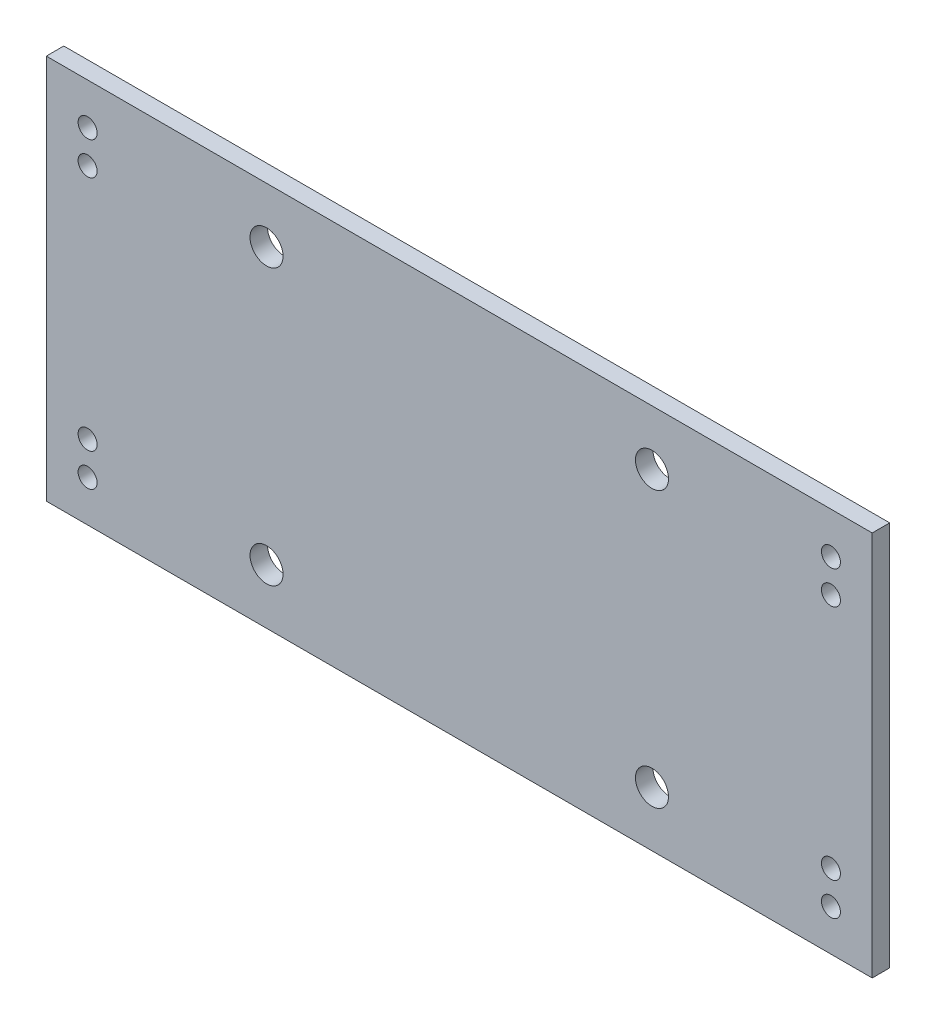
ISO-10303-21;
HEADER;
FILE_DESCRIPTION(('STEP AP214'),'2;1');
FILE_NAME('part.step','',(''),(''),'','','');
FILE_SCHEMA(('AUTOMOTIVE_DESIGN { 1 0 10303 214 1 1 1 1 }'));
ENDSEC;
DATA;
#1=APPLICATION_CONTEXT('core data for automotive mechanical design processes');
#2=APPLICATION_PROTOCOL_DEFINITION('international standard','automotive_design',2000,#1);
#3=PRODUCT_CONTEXT('',#1,'mechanical');
#4=PRODUCT('Part','Part','',(#3));
#5=PRODUCT_RELATED_PRODUCT_CATEGORY('part','',(#4));
#6=PRODUCT_DEFINITION_FORMATION('','',#4);
#7=PRODUCT_DEFINITION_CONTEXT('part definition',#1,'design');
#8=PRODUCT_DEFINITION('design','',#6,#7);
#9=PRODUCT_DEFINITION_SHAPE('','',#8);
#10=(LENGTH_UNIT() NAMED_UNIT(*) SI_UNIT(.MILLI.,.METRE.));
#11=(NAMED_UNIT(*) PLANE_ANGLE_UNIT() SI_UNIT($,.RADIAN.));
#12=(NAMED_UNIT(*) SI_UNIT($,.STERADIAN.) SOLID_ANGLE_UNIT());
#13=UNCERTAINTY_MEASURE_WITH_UNIT(LENGTH_MEASURE(1.E-05),#10,'distance_accuracy_value','');
#14=(GEOMETRIC_REPRESENTATION_CONTEXT(3) GLOBAL_UNCERTAINTY_ASSIGNED_CONTEXT((#13)) GLOBAL_UNIT_ASSIGNED_CONTEXT((#10,
#11,#12)) REPRESENTATION_CONTEXT('',''));
#15=CARTESIAN_POINT('',(0.,0.,0.));
#16=DIRECTION('',(0.,0.,1.));
#17=DIRECTION('',(1.,0.,0.));
#18=AXIS2_PLACEMENT_3D('',#15,#16,#17);
#19=CARTESIAN_POINT('',(150.,0.,3.175));
#20=DIRECTION('',(1.,0.,0.));
#21=DIRECTION('',(0.,0.,-1.));
#22=AXIS2_PLACEMENT_3D('',#19,#20,#21);
#23=PLANE('',#22);
#24=DIRECTION('',(0.,-1.,0.));
#25=VECTOR('',#24,1.);
#26=CARTESIAN_POINT('',(150.,0.,0.));
#27=LINE('',#26,#25);
#28=CARTESIAN_POINT('',(150.,0.,0.));
#29=VERTEX_POINT('',#28);
#30=CARTESIAN_POINT('',(150.,-70.,0.));
#31=VERTEX_POINT('',#30);
#32=EDGE_CURVE('E167',#29,#31,#27,.T.);
#33=ORIENTED_EDGE('',*,*,#32,.F.);
#34=DIRECTION('',(0.,0.,-1.));
#35=VECTOR('',#34,1.);
#36=CARTESIAN_POINT('',(150.,0.,3.175));
#37=LINE('',#36,#35);
#38=CARTESIAN_POINT('',(150.,0.,3.175));
#39=VERTEX_POINT('',#38);
#40=EDGE_CURVE('E11',#39,#29,#37,.T.);
#41=ORIENTED_EDGE('',*,*,#40,.F.);
#42=DIRECTION('',(0.,-1.,0.));
#43=VECTOR('',#42,1.);
#44=CARTESIAN_POINT('',(150.,0.,3.175));
#45=LINE('',#44,#43);
#46=CARTESIAN_POINT('',(150.,-70.,3.175));
#47=VERTEX_POINT('',#46);
#48=EDGE_CURVE('E109',#39,#47,#45,.T.);
#49=ORIENTED_EDGE('',*,*,#48,.T.);
#50=DIRECTION('',(0.,0.,-1.));
#51=VECTOR('',#50,1.);
#52=CARTESIAN_POINT('',(150.,-70.,3.175));
#53=LINE('',#52,#51);
#54=EDGE_CURVE('E86',#47,#31,#53,.T.);
#55=ORIENTED_EDGE('',*,*,#54,.T.);
#56=EDGE_LOOP('',(#33,#41,#49,#55));
#57=FACE_BOUND('',#56,.T.);
#58=ADVANCED_FACE('F45',(#57),#23,.T.);
#59=CARTESIAN_POINT('',(0.,0.,3.175));
#60=DIRECTION('',(0.,1.,0.));
#61=DIRECTION('',(0.,0.,1.));
#62=AXIS2_PLACEMENT_3D('',#59,#60,#61);
#63=PLANE('',#62);
#64=DIRECTION('',(1.,0.,0.));
#65=VECTOR('',#64,1.);
#66=CARTESIAN_POINT('',(0.,0.,0.));
#67=LINE('',#66,#65);
#68=CARTESIAN_POINT('',(0.,0.,0.));
#69=VERTEX_POINT('',#68);
#70=EDGE_CURVE('E98',#69,#29,#67,.T.);
#71=ORIENTED_EDGE('',*,*,#70,.F.);
#72=DIRECTION('',(0.,0.,-1.));
#73=VECTOR('',#72,1.);
#74=CARTESIAN_POINT('',(0.,0.,3.175));
#75=LINE('',#74,#73);
#76=CARTESIAN_POINT('',(0.,0.,3.175));
#77=VERTEX_POINT('',#76);
#78=EDGE_CURVE('E55',#77,#69,#75,.T.);
#79=ORIENTED_EDGE('',*,*,#78,.F.);
#80=DIRECTION('',(1.,0.,0.));
#81=VECTOR('',#80,1.);
#82=CARTESIAN_POINT('',(0.,0.,3.175));
#83=LINE('',#82,#81);
#84=EDGE_CURVE('E96',#77,#39,#83,.T.);
#85=ORIENTED_EDGE('',*,*,#84,.T.);
#86=ORIENTED_EDGE('',*,*,#40,.T.);
#87=EDGE_LOOP('',(#71,#79,#85,#86));
#88=FACE_BOUND('',#87,.T.);
#89=ADVANCED_FACE('F94',(#88),#63,.T.);
#90=CARTESIAN_POINT('',(0.,0.,3.175));
#91=DIRECTION('',(1.,0.,0.));
#92=DIRECTION('',(0.,1.,0.));
#93=AXIS2_PLACEMENT_3D('',#90,#91,#92);
#94=PLANE('',#93);
#95=DIRECTION('',(0.,-1.,0.));
#96=VECTOR('',#95,1.);
#97=CARTESIAN_POINT('',(0.,0.,0.));
#98=LINE('',#97,#96);
#99=CARTESIAN_POINT('',(0.,-70.,0.));
#100=VERTEX_POINT('',#99);
#101=EDGE_CURVE('E172',#69,#100,#98,.T.);
#102=ORIENTED_EDGE('',*,*,#101,.T.);
#103=DIRECTION('',(0.,0.,-1.));
#104=VECTOR('',#103,1.);
#105=CARTESIAN_POINT('',(0.,-70.,3.175));
#106=LINE('',#105,#104);
#107=CARTESIAN_POINT('',(0.,-70.,3.175));
#108=VERTEX_POINT('',#107);
#109=EDGE_CURVE('E102',#108,#100,#106,.T.);
#110=ORIENTED_EDGE('',*,*,#109,.F.);
#111=DIRECTION('',(0.,-1.,0.));
#112=VECTOR('',#111,1.);
#113=CARTESIAN_POINT('',(0.,0.,3.175));
#114=LINE('',#113,#112);
#115=EDGE_CURVE('E104',#77,#108,#114,.T.);
#116=ORIENTED_EDGE('',*,*,#115,.F.);
#117=ORIENTED_EDGE('',*,*,#78,.T.);
#118=EDGE_LOOP('',(#102,#110,#116,#117));
#119=FACE_BOUND('',#118,.T.);
#120=ADVANCED_FACE('F105',(#119),#94,.F.);
#121=CARTESIAN_POINT('',(7.49999999999998,-7.49999999999998,3.175));
#122=DIRECTION('',(0.,0.,-1.));
#123=DIRECTION('',(-1.,0.,0.));
#124=AXIS2_PLACEMENT_3D('',#121,#122,#123);
#125=CYLINDRICAL_SURFACE('',#124,1.725);
#126=CARTESIAN_POINT('',(7.49999999999998,-7.49999999999998,3.175));
#127=DIRECTION('',(0.,0.,1.));
#128=DIRECTION('',(1.,0.,0.));
#129=AXIS2_PLACEMENT_3D('',#126,#127,#128);
#130=CIRCLE('',#129,1.725);
#131=CARTESIAN_POINT('',(9.22499999999998,-7.49999999999998,3.175));
#132=VERTEX_POINT('',#131);
#133=EDGE_CURVE('E113',#132,#132,#130,.T.);
#134=ORIENTED_EDGE('',*,*,#133,.T.);
#135=EDGE_LOOP('',(#134));
#136=FACE_BOUND('',#135,.T.);
#137=CARTESIAN_POINT('',(7.49999999999998,-7.49999999999998,0.));
#138=DIRECTION('',(0.,0.,1.));
#139=DIRECTION('',(1.,0.,0.));
#140=AXIS2_PLACEMENT_3D('',#137,#138,#139);
#141=CIRCLE('',#140,1.725);
#142=CARTESIAN_POINT('',(9.22499999999998,-7.49999999999998,0.));
#143=VERTEX_POINT('',#142);
#144=EDGE_CURVE('E163',#143,#143,#141,.T.);
#145=ORIENTED_EDGE('',*,*,#144,.F.);
#146=EDGE_LOOP('',(#145));
#147=FACE_BOUND('',#146,.T.);
#148=ADVANCED_FACE('F192',(#136,#147),#125,.F.);
#149=CARTESIAN_POINT('',(142.5,-7.49999999999999,3.175));
#150=DIRECTION('',(0.,0.,-1.));
#151=DIRECTION('',(-1.,0.,0.));
#152=AXIS2_PLACEMENT_3D('',#149,#150,#151);
#153=CYLINDRICAL_SURFACE('',#152,1.72500000000002);
#154=CARTESIAN_POINT('',(142.5,-7.49999999999999,3.175));
#155=DIRECTION('',(0.,0.,1.));
#156=DIRECTION('',(1.,0.,0.));
#157=AXIS2_PLACEMENT_3D('',#154,#155,#156);
#158=CIRCLE('',#157,1.72500000000002);
#159=CARTESIAN_POINT('',(144.225,-7.49999999999999,3.175));
#160=VERTEX_POINT('',#159);
#161=EDGE_CURVE('E464',#160,#160,#158,.T.);
#162=ORIENTED_EDGE('',*,*,#161,.T.);
#163=EDGE_LOOP('',(#162));
#164=FACE_BOUND('',#163,.T.);
#165=CARTESIAN_POINT('',(142.5,-7.49999999999999,0.));
#166=DIRECTION('',(0.,0.,1.));
#167=DIRECTION('',(1.,0.,0.));
#168=AXIS2_PLACEMENT_3D('',#165,#166,#167);
#169=CIRCLE('',#168,1.72500000000002);
#170=CARTESIAN_POINT('',(144.225,-7.49999999999999,0.));
#171=VERTEX_POINT('',#170);
#172=EDGE_CURVE('E159',#171,#171,#169,.T.);
#173=ORIENTED_EDGE('',*,*,#172,.F.);
#174=EDGE_LOOP('',(#173));
#175=FACE_BOUND('',#174,.T.);
#176=ADVANCED_FACE('F195',(#164,#175),#153,.F.);
#177=CARTESIAN_POINT('',(142.5,-62.5,3.175));
#178=DIRECTION('',(0.,0.,-1.));
#179=DIRECTION('',(-1.,0.,0.));
#180=AXIS2_PLACEMENT_3D('',#177,#178,#179);
#181=CYLINDRICAL_SURFACE('',#180,1.725);
#182=CARTESIAN_POINT('',(142.5,-62.5,3.175));
#183=DIRECTION('',(0.,0.,1.));
#184=DIRECTION('',(1.,0.,0.));
#185=AXIS2_PLACEMENT_3D('',#182,#183,#184);
#186=CIRCLE('',#185,1.725);
#187=CARTESIAN_POINT('',(144.225,-62.5,3.175));
#188=VERTEX_POINT('',#187);
#189=EDGE_CURVE('E460',#188,#188,#186,.T.);
#190=ORIENTED_EDGE('',*,*,#189,.T.);
#191=EDGE_LOOP('',(#190));
#192=FACE_BOUND('',#191,.T.);
#193=CARTESIAN_POINT('',(142.5,-62.5,0.));
#194=DIRECTION('',(0.,0.,1.));
#195=DIRECTION('',(1.,0.,0.));
#196=AXIS2_PLACEMENT_3D('',#193,#194,#195);
#197=CIRCLE('',#196,1.725);
#198=CARTESIAN_POINT('',(144.225,-62.5,0.));
#199=VERTEX_POINT('',#198);
#200=EDGE_CURVE('E155',#199,#199,#197,.T.);
#201=ORIENTED_EDGE('',*,*,#200,.F.);
#202=EDGE_LOOP('',(#201));
#203=FACE_BOUND('',#202,.T.);
#204=ADVANCED_FACE('F199',(#192,#203),#181,.F.);
#205=CARTESIAN_POINT('',(7.5,-62.5,3.175));
#206=DIRECTION('',(0.,0.,-1.));
#207=DIRECTION('',(-1.,0.,0.));
#208=AXIS2_PLACEMENT_3D('',#205,#206,#207);
#209=CYLINDRICAL_SURFACE('',#208,1.72499999999999);
#210=CARTESIAN_POINT('',(7.5,-62.5,3.175));
#211=DIRECTION('',(0.,0.,1.));
#212=DIRECTION('',(1.,0.,0.));
#213=AXIS2_PLACEMENT_3D('',#210,#211,#212);
#214=CIRCLE('',#213,1.72499999999999);
#215=CARTESIAN_POINT('',(9.22499999999999,-62.5,3.175));
#216=VERTEX_POINT('',#215);
#217=EDGE_CURVE('E456',#216,#216,#214,.T.);
#218=ORIENTED_EDGE('',*,*,#217,.T.);
#219=EDGE_LOOP('',(#218));
#220=FACE_BOUND('',#219,.T.);
#221=CARTESIAN_POINT('',(7.5,-62.5,0.));
#222=DIRECTION('',(0.,0.,1.));
#223=DIRECTION('',(1.,0.,0.));
#224=AXIS2_PLACEMENT_3D('',#221,#222,#223);
#225=CIRCLE('',#224,1.72499999999999);
#226=CARTESIAN_POINT('',(9.22499999999999,-62.5,0.));
#227=VERTEX_POINT('',#226);
#228=EDGE_CURVE('E151',#227,#227,#225,.T.);
#229=ORIENTED_EDGE('',*,*,#228,.F.);
#230=EDGE_LOOP('',(#229));
#231=FACE_BOUND('',#230,.T.);
#232=ADVANCED_FACE('F203',(#220,#231),#209,.F.);
#233=CARTESIAN_POINT('',(7.49999999999998,-13.5,3.175));
#234=DIRECTION('',(0.,0.,-1.));
#235=DIRECTION('',(-1.,0.,0.));
#236=AXIS2_PLACEMENT_3D('',#233,#234,#235);
#237=CYLINDRICAL_SURFACE('',#236,1.72500000000003);
#238=CARTESIAN_POINT('',(7.49999999999998,-13.5,3.175));
#239=DIRECTION('',(0.,0.,1.));
#240=DIRECTION('',(1.,0.,0.));
#241=AXIS2_PLACEMENT_3D('',#238,#239,#240);
#242=CIRCLE('',#241,1.72500000000003);
#243=CARTESIAN_POINT('',(9.22500000000001,-13.5,3.175));
#244=VERTEX_POINT('',#243);
#245=EDGE_CURVE('E452',#244,#244,#242,.T.);
#246=ORIENTED_EDGE('',*,*,#245,.T.);
#247=EDGE_LOOP('',(#246));
#248=FACE_BOUND('',#247,.T.);
#249=CARTESIAN_POINT('',(7.49999999999998,-13.5,0.));
#250=DIRECTION('',(0.,0.,1.));
#251=DIRECTION('',(1.,0.,0.));
#252=AXIS2_PLACEMENT_3D('',#249,#250,#251);
#253=CIRCLE('',#252,1.72500000000003);
#254=CARTESIAN_POINT('',(9.22500000000001,-13.5,0.));
#255=VERTEX_POINT('',#254);
#256=EDGE_CURVE('E147',#255,#255,#253,.T.);
#257=ORIENTED_EDGE('',*,*,#256,.F.);
#258=EDGE_LOOP('',(#257));
#259=FACE_BOUND('',#258,.T.);
#260=ADVANCED_FACE('F207',(#248,#259),#237,.F.);
#261=CARTESIAN_POINT('',(142.5,-13.5,3.175));
#262=DIRECTION('',(0.,0.,-1.));
#263=DIRECTION('',(-1.,0.,0.));
#264=AXIS2_PLACEMENT_3D('',#261,#262,#263);
#265=CYLINDRICAL_SURFACE('',#264,1.725);
#266=CARTESIAN_POINT('',(142.5,-13.5,3.175));
#267=DIRECTION('',(0.,0.,1.));
#268=DIRECTION('',(1.,0.,0.));
#269=AXIS2_PLACEMENT_3D('',#266,#267,#268);
#270=CIRCLE('',#269,1.725);
#271=CARTESIAN_POINT('',(144.225,-13.5,3.175));
#272=VERTEX_POINT('',#271);
#273=EDGE_CURVE('E448',#272,#272,#270,.T.);
#274=ORIENTED_EDGE('',*,*,#273,.T.);
#275=EDGE_LOOP('',(#274));
#276=FACE_BOUND('',#275,.T.);
#277=CARTESIAN_POINT('',(142.5,-13.5,0.));
#278=DIRECTION('',(0.,0.,1.));
#279=DIRECTION('',(1.,0.,0.));
#280=AXIS2_PLACEMENT_3D('',#277,#278,#279);
#281=CIRCLE('',#280,1.725);
#282=CARTESIAN_POINT('',(144.225,-13.5,0.));
#283=VERTEX_POINT('',#282);
#284=EDGE_CURVE('E143',#283,#283,#281,.T.);
#285=ORIENTED_EDGE('',*,*,#284,.F.);
#286=EDGE_LOOP('',(#285));
#287=FACE_BOUND('',#286,.T.);
#288=ADVANCED_FACE('F211',(#276,#287),#265,.F.);
#289=CARTESIAN_POINT('',(142.5,-56.5,3.175));
#290=DIRECTION('',(0.,0.,-1.));
#291=DIRECTION('',(-1.,0.,0.));
#292=AXIS2_PLACEMENT_3D('',#289,#290,#291);
#293=CYLINDRICAL_SURFACE('',#292,1.725);
#294=CARTESIAN_POINT('',(142.5,-56.5,3.175));
#295=DIRECTION('',(0.,0.,1.));
#296=DIRECTION('',(1.,0.,0.));
#297=AXIS2_PLACEMENT_3D('',#294,#295,#296);
#298=CIRCLE('',#297,1.725);
#299=CARTESIAN_POINT('',(144.225,-56.5,3.175));
#300=VERTEX_POINT('',#299);
#301=EDGE_CURVE('E444',#300,#300,#298,.T.);
#302=ORIENTED_EDGE('',*,*,#301,.T.);
#303=EDGE_LOOP('',(#302));
#304=FACE_BOUND('',#303,.T.);
#305=CARTESIAN_POINT('',(142.5,-56.5,0.));
#306=DIRECTION('',(0.,0.,1.));
#307=DIRECTION('',(1.,0.,0.));
#308=AXIS2_PLACEMENT_3D('',#305,#306,#307);
#309=CIRCLE('',#308,1.725);
#310=CARTESIAN_POINT('',(144.225,-56.5,0.));
#311=VERTEX_POINT('',#310);
#312=EDGE_CURVE('E139',#311,#311,#309,.T.);
#313=ORIENTED_EDGE('',*,*,#312,.F.);
#314=EDGE_LOOP('',(#313));
#315=FACE_BOUND('',#314,.T.);
#316=ADVANCED_FACE('F215',(#304,#315),#293,.F.);
#317=CARTESIAN_POINT('',(7.49999999999999,-56.5,3.175));
#318=DIRECTION('',(0.,0.,-1.));
#319=DIRECTION('',(-1.,0.,0.));
#320=AXIS2_PLACEMENT_3D('',#317,#318,#319);
#321=CYLINDRICAL_SURFACE('',#320,1.72500000000002);
#322=CARTESIAN_POINT('',(7.49999999999999,-56.5,3.175));
#323=DIRECTION('',(0.,0.,1.));
#324=DIRECTION('',(1.,0.,0.));
#325=AXIS2_PLACEMENT_3D('',#322,#323,#324);
#326=CIRCLE('',#325,1.72500000000002);
#327=CARTESIAN_POINT('',(9.22500000000001,-56.5,3.175));
#328=VERTEX_POINT('',#327);
#329=EDGE_CURVE('E440',#328,#328,#326,.T.);
#330=ORIENTED_EDGE('',*,*,#329,.T.);
#331=EDGE_LOOP('',(#330));
#332=FACE_BOUND('',#331,.T.);
#333=CARTESIAN_POINT('',(7.49999999999999,-56.5,0.));
#334=DIRECTION('',(0.,0.,1.));
#335=DIRECTION('',(1.,0.,0.));
#336=AXIS2_PLACEMENT_3D('',#333,#334,#335);
#337=CIRCLE('',#336,1.72500000000002);
#338=CARTESIAN_POINT('',(9.22500000000001,-56.5,0.));
#339=VERTEX_POINT('',#338);
#340=EDGE_CURVE('E135',#339,#339,#337,.T.);
#341=ORIENTED_EDGE('',*,*,#340,.F.);
#342=EDGE_LOOP('',(#341));
#343=FACE_BOUND('',#342,.T.);
#344=ADVANCED_FACE('F219',(#332,#343),#321,.F.);
#345=CARTESIAN_POINT('',(40.,-10.,3.175));
#346=DIRECTION('',(0.,0.,-1.));
#347=DIRECTION('',(-1.,0.,0.));
#348=AXIS2_PLACEMENT_3D('',#345,#346,#347);
#349=CYLINDRICAL_SURFACE('',#348,3.);
#350=CARTESIAN_POINT('',(40.,-10.,3.175));
#351=DIRECTION('',(0.,0.,1.));
#352=DIRECTION('',(1.,0.,0.));
#353=AXIS2_PLACEMENT_3D('',#350,#351,#352);
#354=CIRCLE('',#353,3.);
#355=CARTESIAN_POINT('',(43.,-10.,3.175));
#356=VERTEX_POINT('',#355);
#357=EDGE_CURVE('E436',#356,#356,#354,.T.);
#358=ORIENTED_EDGE('',*,*,#357,.T.);
#359=EDGE_LOOP('',(#358));
#360=FACE_BOUND('',#359,.T.);
#361=CARTESIAN_POINT('',(40.,-10.,0.));
#362=DIRECTION('',(0.,0.,1.));
#363=DIRECTION('',(1.,0.,0.));
#364=AXIS2_PLACEMENT_3D('',#361,#362,#363);
#365=CIRCLE('',#364,3.);
#366=CARTESIAN_POINT('',(43.,-10.,0.));
#367=VERTEX_POINT('',#366);
#368=EDGE_CURVE('E131',#367,#367,#365,.T.);
#369=ORIENTED_EDGE('',*,*,#368,.F.);
#370=EDGE_LOOP('',(#369));
#371=FACE_BOUND('',#370,.T.);
#372=ADVANCED_FACE('F223',(#360,#371),#349,.F.);
#373=CARTESIAN_POINT('',(40.,-60.0000000000001,3.175));
#374=DIRECTION('',(0.,0.,-1.));
#375=DIRECTION('',(-1.,0.,0.));
#376=AXIS2_PLACEMENT_3D('',#373,#374,#375);
#377=CYLINDRICAL_SURFACE('',#376,3.);
#378=CARTESIAN_POINT('',(40.,-60.0000000000001,3.175));
#379=DIRECTION('',(0.,0.,1.));
#380=DIRECTION('',(1.,0.,0.));
#381=AXIS2_PLACEMENT_3D('',#378,#379,#380);
#382=CIRCLE('',#381,3.);
#383=CARTESIAN_POINT('',(43.,-60.0000000000001,3.175));
#384=VERTEX_POINT('',#383);
#385=EDGE_CURVE('E432',#384,#384,#382,.T.);
#386=ORIENTED_EDGE('',*,*,#385,.T.);
#387=EDGE_LOOP('',(#386));
#388=FACE_BOUND('',#387,.T.);
#389=CARTESIAN_POINT('',(40.,-60.0000000000001,0.));
#390=DIRECTION('',(0.,0.,1.));
#391=DIRECTION('',(1.,0.,0.));
#392=AXIS2_PLACEMENT_3D('',#389,#390,#391);
#393=CIRCLE('',#392,3.);
#394=CARTESIAN_POINT('',(43.,-60.0000000000001,0.));
#395=VERTEX_POINT('',#394);
#396=EDGE_CURVE('E127',#395,#395,#393,.T.);
#397=ORIENTED_EDGE('',*,*,#396,.F.);
#398=EDGE_LOOP('',(#397));
#399=FACE_BOUND('',#398,.T.);
#400=ADVANCED_FACE('F227',(#388,#399),#377,.F.);
#401=CARTESIAN_POINT('',(110.,-10.,3.175));
#402=DIRECTION('',(0.,0.,-1.));
#403=DIRECTION('',(-1.,0.,0.));
#404=AXIS2_PLACEMENT_3D('',#401,#402,#403);
#405=CYLINDRICAL_SURFACE('',#404,2.99999999999999);
#406=CARTESIAN_POINT('',(110.,-10.,3.175));
#407=DIRECTION('',(0.,0.,1.));
#408=DIRECTION('',(1.,0.,0.));
#409=AXIS2_PLACEMENT_3D('',#406,#407,#408);
#410=CIRCLE('',#409,2.99999999999999);
#411=CARTESIAN_POINT('',(113.,-10.,3.175));
#412=VERTEX_POINT('',#411);
#413=EDGE_CURVE('E241',#412,#412,#410,.T.);
#414=ORIENTED_EDGE('',*,*,#413,.T.);
#415=EDGE_LOOP('',(#414));
#416=FACE_BOUND('',#415,.T.);
#417=CARTESIAN_POINT('',(110.,-10.,0.));
#418=DIRECTION('',(0.,0.,1.));
#419=DIRECTION('',(1.,0.,0.));
#420=AXIS2_PLACEMENT_3D('',#417,#418,#419);
#421=CIRCLE('',#420,2.99999999999999);
#422=CARTESIAN_POINT('',(113.,-10.,0.));
#423=VERTEX_POINT('',#422);
#424=EDGE_CURVE('E123',#423,#423,#421,.T.);
#425=ORIENTED_EDGE('',*,*,#424,.F.);
#426=EDGE_LOOP('',(#425));
#427=FACE_BOUND('',#426,.T.);
#428=ADVANCED_FACE('F230',(#416,#427),#405,.F.);
#429=CARTESIAN_POINT('',(110.,-60.0000000000001,3.175));
#430=DIRECTION('',(0.,0.,-1.));
#431=DIRECTION('',(-1.,0.,0.));
#432=AXIS2_PLACEMENT_3D('',#429,#430,#431);
#433=CYLINDRICAL_SURFACE('',#432,2.99999999999998);
#434=CARTESIAN_POINT('',(110.,-60.0000000000001,3.175));
#435=DIRECTION('',(0.,0.,1.));
#436=DIRECTION('',(1.,0.,0.));
#437=AXIS2_PLACEMENT_3D('',#434,#435,#436);
#438=CIRCLE('',#437,2.99999999999998);
#439=CARTESIAN_POINT('',(113.,-60.0000000000001,3.175));
#440=VERTEX_POINT('',#439);
#441=EDGE_CURVE('E177',#440,#440,#438,.T.);
#442=ORIENTED_EDGE('',*,*,#441,.T.);
#443=EDGE_LOOP('',(#442));
#444=FACE_BOUND('',#443,.T.);
#445=CARTESIAN_POINT('',(110.,-60.0000000000001,0.));
#446=DIRECTION('',(0.,0.,1.));
#447=DIRECTION('',(1.,0.,0.));
#448=AXIS2_PLACEMENT_3D('',#445,#446,#447);
#449=CIRCLE('',#448,2.99999999999998);
#450=CARTESIAN_POINT('',(113.,-60.0000000000001,0.));
#451=VERTEX_POINT('',#450);
#452=EDGE_CURVE('E119',#451,#451,#449,.T.);
#453=ORIENTED_EDGE('',*,*,#452,.F.);
#454=EDGE_LOOP('',(#453));
#455=FACE_BOUND('',#454,.T.);
#456=ADVANCED_FACE('F47',(#444,#455),#433,.F.);
#457=CARTESIAN_POINT('',(0.,-70.,3.175));
#458=DIRECTION('',(0.,1.,0.));
#459=DIRECTION('',(0.,0.,1.));
#460=AXIS2_PLACEMENT_3D('',#457,#458,#459);
#461=PLANE('',#460);
#462=DIRECTION('',(1.,0.,0.));
#463=VECTOR('',#462,1.);
#464=CARTESIAN_POINT('',(0.,-70.,0.));
#465=LINE('',#464,#463);
#466=EDGE_CURVE('E79',#100,#31,#465,.T.);
#467=ORIENTED_EDGE('',*,*,#466,.T.);
#468=ORIENTED_EDGE('',*,*,#54,.F.);
#469=DIRECTION('',(1.,0.,0.));
#470=VECTOR('',#469,1.);
#471=CARTESIAN_POINT('',(0.,-70.,3.175));
#472=LINE('',#471,#470);
#473=EDGE_CURVE('E63',#108,#47,#472,.T.);
#474=ORIENTED_EDGE('',*,*,#473,.F.);
#475=ORIENTED_EDGE('',*,*,#109,.T.);
#476=EDGE_LOOP('',(#467,#468,#474,#475));
#477=FACE_BOUND('',#476,.T.);
#478=ADVANCED_FACE('F182',(#477),#461,.F.);
#479=CARTESIAN_POINT('',(0.,0.,3.175));
#480=DIRECTION('',(0.,0.,1.));
#481=DIRECTION('',(1.,0.,0.));
#482=AXIS2_PLACEMENT_3D('',#479,#480,#481);
#483=PLANE('',#482);
#484=ORIENTED_EDGE('',*,*,#441,.F.);
#485=EDGE_LOOP('',(#484));
#486=FACE_BOUND('',#485,.T.);
#487=ORIENTED_EDGE('',*,*,#413,.F.);
#488=EDGE_LOOP('',(#487));
#489=FACE_BOUND('',#488,.T.);
#490=ORIENTED_EDGE('',*,*,#385,.F.);
#491=EDGE_LOOP('',(#490));
#492=FACE_BOUND('',#491,.T.);
#493=ORIENTED_EDGE('',*,*,#357,.F.);
#494=EDGE_LOOP('',(#493));
#495=FACE_BOUND('',#494,.T.);
#496=ORIENTED_EDGE('',*,*,#329,.F.);
#497=EDGE_LOOP('',(#496));
#498=FACE_BOUND('',#497,.T.);
#499=ORIENTED_EDGE('',*,*,#301,.F.);
#500=EDGE_LOOP('',(#499));
#501=FACE_BOUND('',#500,.T.);
#502=ORIENTED_EDGE('',*,*,#273,.F.);
#503=EDGE_LOOP('',(#502));
#504=FACE_BOUND('',#503,.T.);
#505=ORIENTED_EDGE('',*,*,#245,.F.);
#506=EDGE_LOOP('',(#505));
#507=FACE_BOUND('',#506,.T.);
#508=ORIENTED_EDGE('',*,*,#217,.F.);
#509=EDGE_LOOP('',(#508));
#510=FACE_BOUND('',#509,.T.);
#511=ORIENTED_EDGE('',*,*,#189,.F.);
#512=EDGE_LOOP('',(#511));
#513=FACE_BOUND('',#512,.T.);
#514=ORIENTED_EDGE('',*,*,#161,.F.);
#515=EDGE_LOOP('',(#514));
#516=FACE_BOUND('',#515,.T.);
#517=ORIENTED_EDGE('',*,*,#133,.F.);
#518=EDGE_LOOP('',(#517));
#519=FACE_BOUND('',#518,.T.);
#520=ORIENTED_EDGE('',*,*,#48,.F.);
#521=ORIENTED_EDGE('',*,*,#84,.F.);
#522=ORIENTED_EDGE('',*,*,#115,.T.);
#523=ORIENTED_EDGE('',*,*,#473,.T.);
#524=EDGE_LOOP('',(#520,#521,#522,#523));
#525=FACE_BOUND('',#524,.T.);
#526=ADVANCED_FACE('F108',(#486,#489,#492,#495,#498,#501,#504,#507,#510,#513,#516,#519,#525),
#483,.T.);
#527=CARTESIAN_POINT('',(0.,0.,0.));
#528=DIRECTION('',(0.,0.,1.));
#529=DIRECTION('',(1.,0.,0.));
#530=AXIS2_PLACEMENT_3D('',#527,#528,#529);
#531=PLANE('',#530);
#532=ORIENTED_EDGE('',*,*,#452,.T.);
#533=EDGE_LOOP('',(#532));
#534=FACE_BOUND('',#533,.T.);
#535=ORIENTED_EDGE('',*,*,#424,.T.);
#536=EDGE_LOOP('',(#535));
#537=FACE_BOUND('',#536,.T.);
#538=ORIENTED_EDGE('',*,*,#396,.T.);
#539=EDGE_LOOP('',(#538));
#540=FACE_BOUND('',#539,.T.);
#541=ORIENTED_EDGE('',*,*,#368,.T.);
#542=EDGE_LOOP('',(#541));
#543=FACE_BOUND('',#542,.T.);
#544=ORIENTED_EDGE('',*,*,#340,.T.);
#545=EDGE_LOOP('',(#544));
#546=FACE_BOUND('',#545,.T.);
#547=ORIENTED_EDGE('',*,*,#312,.T.);
#548=EDGE_LOOP('',(#547));
#549=FACE_BOUND('',#548,.T.);
#550=ORIENTED_EDGE('',*,*,#284,.T.);
#551=EDGE_LOOP('',(#550));
#552=FACE_BOUND('',#551,.T.);
#553=ORIENTED_EDGE('',*,*,#256,.T.);
#554=EDGE_LOOP('',(#553));
#555=FACE_BOUND('',#554,.T.);
#556=ORIENTED_EDGE('',*,*,#228,.T.);
#557=EDGE_LOOP('',(#556));
#558=FACE_BOUND('',#557,.T.);
#559=ORIENTED_EDGE('',*,*,#200,.T.);
#560=EDGE_LOOP('',(#559));
#561=FACE_BOUND('',#560,.T.);
#562=ORIENTED_EDGE('',*,*,#172,.T.);
#563=EDGE_LOOP('',(#562));
#564=FACE_BOUND('',#563,.T.);
#565=ORIENTED_EDGE('',*,*,#144,.T.);
#566=EDGE_LOOP('',(#565));
#567=FACE_BOUND('',#566,.T.);
#568=ORIENTED_EDGE('',*,*,#32,.T.);
#569=ORIENTED_EDGE('',*,*,#466,.F.);
#570=ORIENTED_EDGE('',*,*,#101,.F.);
#571=ORIENTED_EDGE('',*,*,#70,.T.);
#572=EDGE_LOOP('',(#568,#569,#570,#571));
#573=FACE_BOUND('',#572,.T.);
#574=ADVANCED_FACE('F183',(#534,#537,#540,#543,#546,#549,#552,#555,#558,#561,#564,#567,#573),
#531,.F.);
#575=CLOSED_SHELL('',(#58,#89,#120,#148,#176,#204,#232,#260,#288,#316,#344,#372,#400,#428,#456,
#478,#526,#574));
#576=MANIFOLD_SOLID_BREP('B2',#575);
#577=ADVANCED_BREP_SHAPE_REPRESENTATION('',(#18,#576),#14);
#578=SHAPE_DEFINITION_REPRESENTATION(#9,#577);
ENDSEC;
END-ISO-10303-21;
